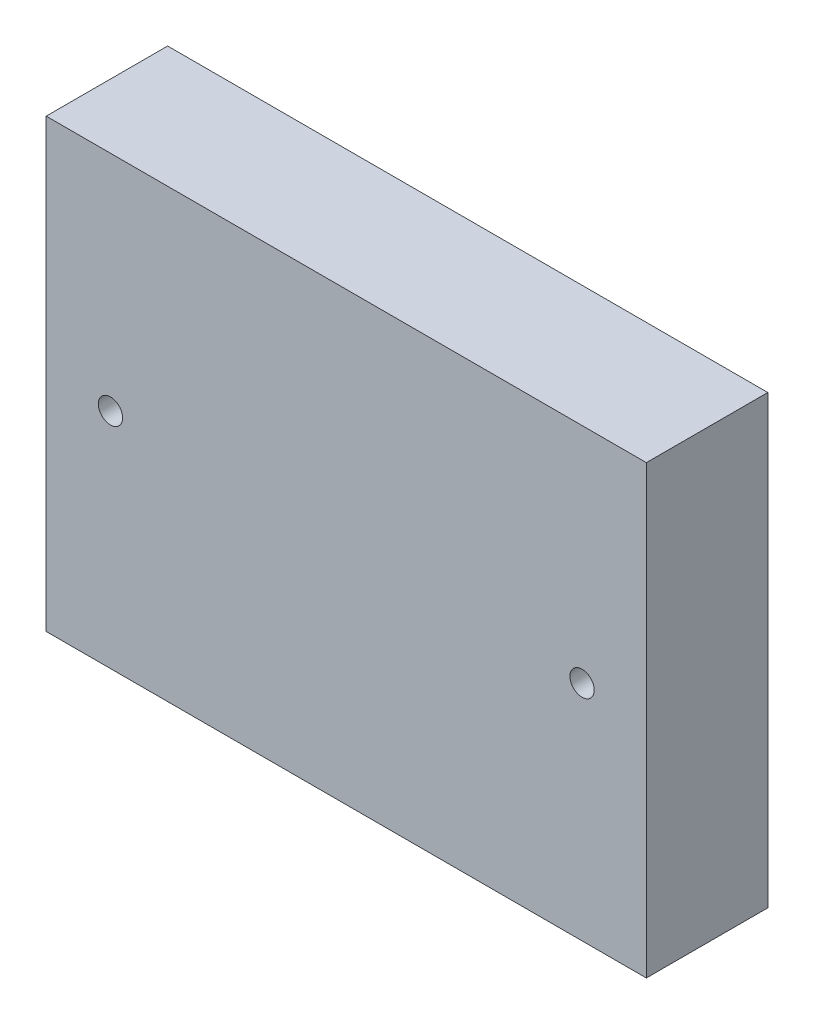
ISO-10303-21;
HEADER;
FILE_DESCRIPTION(('STEP AP214'),'2;1');
FILE_NAME('part.step','',(''),(''),'','','');
FILE_SCHEMA(('AUTOMOTIVE_DESIGN { 1 0 10303 214 1 1 1 1 }'));
ENDSEC;
DATA;
#1=APPLICATION_CONTEXT('core data for automotive mechanical design processes');
#2=APPLICATION_PROTOCOL_DEFINITION('international standard','automotive_design',2000,#1);
#3=PRODUCT_CONTEXT('',#1,'mechanical');
#4=PRODUCT('Part','Part','',(#3));
#5=PRODUCT_RELATED_PRODUCT_CATEGORY('part','',(#4));
#6=PRODUCT_DEFINITION_FORMATION('','',#4);
#7=PRODUCT_DEFINITION_CONTEXT('part definition',#1,'design');
#8=PRODUCT_DEFINITION('design','',#6,#7);
#9=PRODUCT_DEFINITION_SHAPE('','',#8);
#10=(LENGTH_UNIT() NAMED_UNIT(*) SI_UNIT(.MILLI.,.METRE.));
#11=(NAMED_UNIT(*) PLANE_ANGLE_UNIT() SI_UNIT($,.RADIAN.));
#12=(NAMED_UNIT(*) SI_UNIT($,.STERADIAN.) SOLID_ANGLE_UNIT());
#13=UNCERTAINTY_MEASURE_WITH_UNIT(LENGTH_MEASURE(1.E-05),#10,'distance_accuracy_value','');
#14=(GEOMETRIC_REPRESENTATION_CONTEXT(3) GLOBAL_UNCERTAINTY_ASSIGNED_CONTEXT((#13)) GLOBAL_UNIT_ASSIGNED_CONTEXT((#10,
#11,#12)) REPRESENTATION_CONTEXT('',''));
#15=CARTESIAN_POINT('',(0.,0.,0.));
#16=DIRECTION('',(0.,0.,1.));
#17=DIRECTION('',(1.,0.,0.));
#18=AXIS2_PLACEMENT_3D('',#15,#16,#17);
#19=CARTESIAN_POINT('',(0.,0.,9.525));
#20=DIRECTION('',(1.,0.,0.));
#21=DIRECTION('',(0.,0.,-1.));
#22=AXIS2_PLACEMENT_3D('',#19,#20,#21);
#23=PLANE('',#22);
#24=DIRECTION('',(0.,-1.,0.));
#25=VECTOR('',#24,1.);
#26=CARTESIAN_POINT('',(0.,0.,0.));
#27=LINE('',#26,#25);
#28=CARTESIAN_POINT('',(0.,35.0012,0.));
#29=VERTEX_POINT('',#28);
#30=CARTESIAN_POINT('',(0.,0.,0.));
#31=VERTEX_POINT('',#30);
#32=EDGE_CURVE('E98',#29,#31,#27,.T.);
#33=ORIENTED_EDGE('',*,*,#32,.T.);
#34=DIRECTION('',(0.,0.,-1.));
#35=VECTOR('',#34,1.);
#36=CARTESIAN_POINT('',(0.,0.,9.525));
#37=LINE('',#36,#35);
#38=CARTESIAN_POINT('',(0.,0.,9.525));
#39=VERTEX_POINT('',#38);
#40=EDGE_CURVE('E11',#39,#31,#37,.T.);
#41=ORIENTED_EDGE('',*,*,#40,.F.);
#42=DIRECTION('',(0.,-1.,0.));
#43=VECTOR('',#42,1.);
#44=CARTESIAN_POINT('',(0.,0.,9.525));
#45=LINE('',#44,#43);
#46=CARTESIAN_POINT('',(0.,35.0012,9.525));
#47=VERTEX_POINT('',#46);
#48=EDGE_CURVE('E86',#47,#39,#45,.T.);
#49=ORIENTED_EDGE('',*,*,#48,.F.);
#50=DIRECTION('',(0.,0.,-1.));
#51=VECTOR('',#50,1.);
#52=CARTESIAN_POINT('',(0.,35.0012,9.525));
#53=LINE('',#52,#51);
#54=EDGE_CURVE('E94',#47,#29,#53,.T.);
#55=ORIENTED_EDGE('',*,*,#54,.T.);
#56=EDGE_LOOP('',(#33,#41,#49,#55));
#57=FACE_BOUND('',#56,.T.);
#58=ADVANCED_FACE('F35',(#57),#23,.F.);
#59=CARTESIAN_POINT('',(0.,0.,9.525));
#60=DIRECTION('',(0.,1.,0.));
#61=DIRECTION('',(0.,0.,1.));
#62=AXIS2_PLACEMENT_3D('',#59,#60,#61);
#63=PLANE('',#62);
#64=DIRECTION('',(1.,0.,0.));
#65=VECTOR('',#64,1.);
#66=CARTESIAN_POINT('',(0.,0.,0.));
#67=LINE('',#66,#65);
#68=CARTESIAN_POINT('',(47.0662,0.,0.));
#69=VERTEX_POINT('',#68);
#70=EDGE_CURVE('E90',#31,#69,#67,.T.);
#71=ORIENTED_EDGE('',*,*,#70,.T.);
#72=DIRECTION('',(0.,0.,-1.));
#73=VECTOR('',#72,1.);
#74=CARTESIAN_POINT('',(47.0662,0.,9.525));
#75=LINE('',#74,#73);
#76=CARTESIAN_POINT('',(47.0662,0.,9.525));
#77=VERTEX_POINT('',#76);
#78=EDGE_CURVE('E43',#77,#69,#75,.T.);
#79=ORIENTED_EDGE('',*,*,#78,.F.);
#80=DIRECTION('',(1.,0.,0.));
#81=VECTOR('',#80,1.);
#82=CARTESIAN_POINT('',(0.,0.,9.525));
#83=LINE('',#82,#81);
#84=EDGE_CURVE('E81',#39,#77,#83,.T.);
#85=ORIENTED_EDGE('',*,*,#84,.F.);
#86=ORIENTED_EDGE('',*,*,#40,.T.);
#87=EDGE_LOOP('',(#71,#79,#85,#86));
#88=FACE_BOUND('',#87,.T.);
#89=ADVANCED_FACE('F89',(#88),#63,.F.);
#90=CARTESIAN_POINT('',(47.0662,0.,9.525));
#91=DIRECTION('',(-1.,0.,0.));
#92=DIRECTION('',(0.,0.,1.));
#93=AXIS2_PLACEMENT_3D('',#90,#91,#92);
#94=PLANE('',#93);
#95=DIRECTION('',(0.,1.,0.));
#96=VECTOR('',#95,1.);
#97=CARTESIAN_POINT('',(47.0662,0.,0.));
#98=LINE('',#97,#96);
#99=CARTESIAN_POINT('',(47.0662,35.0012,0.));
#100=VERTEX_POINT('',#99);
#101=EDGE_CURVE('E68',#69,#100,#98,.T.);
#102=ORIENTED_EDGE('',*,*,#101,.T.);
#103=DIRECTION('',(0.,0.,-1.));
#104=VECTOR('',#103,1.);
#105=CARTESIAN_POINT('',(47.0662,35.0012,9.525));
#106=LINE('',#105,#104);
#107=CARTESIAN_POINT('',(47.0662,35.0012,9.525));
#108=VERTEX_POINT('',#107);
#109=EDGE_CURVE('E91',#108,#100,#106,.T.);
#110=ORIENTED_EDGE('',*,*,#109,.F.);
#111=DIRECTION('',(0.,1.,0.));
#112=VECTOR('',#111,1.);
#113=CARTESIAN_POINT('',(47.0662,0.,9.525));
#114=LINE('',#113,#112);
#115=EDGE_CURVE('E84',#77,#108,#114,.T.);
#116=ORIENTED_EDGE('',*,*,#115,.F.);
#117=ORIENTED_EDGE('',*,*,#78,.T.);
#118=EDGE_LOOP('',(#102,#110,#116,#117));
#119=FACE_BOUND('',#118,.T.);
#120=ADVANCED_FACE('F92',(#119),#94,.F.);
#121=CARTESIAN_POINT('',(0.,35.0012,9.525));
#122=DIRECTION('',(0.,-1.,0.));
#123=DIRECTION('',(0.,0.,-1.));
#124=AXIS2_PLACEMENT_3D('',#121,#122,#123);
#125=PLANE('',#124);
#126=DIRECTION('',(-1.,0.,0.));
#127=VECTOR('',#126,1.);
#128=CARTESIAN_POINT('',(0.,35.0012,0.));
#129=LINE('',#128,#127);
#130=EDGE_CURVE('E74',#100,#29,#129,.T.);
#131=ORIENTED_EDGE('',*,*,#130,.T.);
#132=ORIENTED_EDGE('',*,*,#54,.F.);
#133=DIRECTION('',(-1.,0.,0.));
#134=VECTOR('',#133,1.);
#135=CARTESIAN_POINT('',(0.,35.0012,9.525));
#136=LINE('',#135,#134);
#137=EDGE_CURVE('E51',#108,#47,#136,.T.);
#138=ORIENTED_EDGE('',*,*,#137,.F.);
#139=ORIENTED_EDGE('',*,*,#109,.T.);
#140=EDGE_LOOP('',(#131,#132,#138,#139));
#141=FACE_BOUND('',#140,.T.);
#142=ADVANCED_FACE('F106',(#141),#125,.F.);
#143=CARTESIAN_POINT('',(0.,0.,9.525));
#144=DIRECTION('',(0.,0.,-1.));
#145=DIRECTION('',(-1.,0.,0.));
#146=AXIS2_PLACEMENT_3D('',#143,#144,#145);
#147=PLANE('',#146);
#148=CARTESIAN_POINT('',(42.0243,17.5006,9.525));
#149=DIRECTION('',(0.,0.,-1.));
#150=DIRECTION('',(1.,0.,0.));
#151=AXIS2_PLACEMENT_3D('',#148,#149,#150);
#152=CIRCLE('',#151,0.952499999999997);
#153=CARTESIAN_POINT('',(42.9768,17.5006,9.525));
#154=VERTEX_POINT('',#153);
#155=EDGE_CURVE('E115',#154,#154,#152,.T.);
#156=ORIENTED_EDGE('',*,*,#155,.T.);
#157=EDGE_LOOP('',(#156));
#158=FACE_BOUND('',#157,.T.);
#159=CARTESIAN_POINT('',(5.04189999999999,17.5006,9.525));
#160=DIRECTION('',(0.,0.,-1.));
#161=DIRECTION('',(-1.,0.,0.));
#162=AXIS2_PLACEMENT_3D('',#159,#160,#161);
#163=CIRCLE('',#162,0.9525);
#164=CARTESIAN_POINT('',(4.0894,17.5006,9.525));
#165=VERTEX_POINT('',#164);
#166=EDGE_CURVE('E101',#165,#165,#163,.T.);
#167=ORIENTED_EDGE('',*,*,#166,.T.);
#168=EDGE_LOOP('',(#167));
#169=FACE_BOUND('',#168,.T.);
#170=ORIENTED_EDGE('',*,*,#48,.T.);
#171=ORIENTED_EDGE('',*,*,#84,.T.);
#172=ORIENTED_EDGE('',*,*,#115,.T.);
#173=ORIENTED_EDGE('',*,*,#137,.T.);
#174=EDGE_LOOP('',(#170,#171,#172,#173));
#175=FACE_BOUND('',#174,.T.);
#176=ADVANCED_FACE('F82',(#158,#169,#175),#147,.F.);
#177=CARTESIAN_POINT('',(0.,0.,0.));
#178=DIRECTION('',(0.,0.,-1.));
#179=DIRECTION('',(-1.,0.,0.));
#180=AXIS2_PLACEMENT_3D('',#177,#178,#179);
#181=PLANE('',#180);
#182=CARTESIAN_POINT('',(42.0243,17.5006,0.));
#183=DIRECTION('',(0.,0.,-1.));
#184=DIRECTION('',(1.,0.,0.));
#185=AXIS2_PLACEMENT_3D('',#182,#183,#184);
#186=CIRCLE('',#185,0.952499999999997);
#187=CARTESIAN_POINT('',(42.9768,17.5006,0.));
#188=VERTEX_POINT('',#187);
#189=EDGE_CURVE('E118',#188,#188,#186,.T.);
#190=ORIENTED_EDGE('',*,*,#189,.F.);
#191=EDGE_LOOP('',(#190));
#192=FACE_BOUND('',#191,.T.);
#193=CARTESIAN_POINT('',(5.04189999999999,17.5006,0.));
#194=DIRECTION('',(0.,0.,-1.));
#195=DIRECTION('',(-1.,0.,0.));
#196=AXIS2_PLACEMENT_3D('',#193,#194,#195);
#197=CIRCLE('',#196,0.9525);
#198=CARTESIAN_POINT('',(4.0894,17.5006,0.));
#199=VERTEX_POINT('',#198);
#200=EDGE_CURVE('E112',#199,#199,#197,.T.);
#201=ORIENTED_EDGE('',*,*,#200,.F.);
#202=EDGE_LOOP('',(#201));
#203=FACE_BOUND('',#202,.T.);
#204=ORIENTED_EDGE('',*,*,#32,.F.);
#205=ORIENTED_EDGE('',*,*,#130,.F.);
#206=ORIENTED_EDGE('',*,*,#101,.F.);
#207=ORIENTED_EDGE('',*,*,#70,.F.);
#208=EDGE_LOOP('',(#204,#205,#206,#207));
#209=FACE_BOUND('',#208,.T.);
#210=ADVANCED_FACE('F109',(#192,#203,#209),#181,.T.);
#211=CARTESIAN_POINT('',(5.04189999999999,17.5006,9.525));
#212=DIRECTION('',(0.,0.,-1.));
#213=DIRECTION('',(-1.,0.,0.));
#214=AXIS2_PLACEMENT_3D('',#211,#212,#213);
#215=CYLINDRICAL_SURFACE('',#214,0.9525);
#216=ORIENTED_EDGE('',*,*,#166,.F.);
#217=EDGE_LOOP('',(#216));
#218=FACE_BOUND('',#217,.T.);
#219=ORIENTED_EDGE('',*,*,#200,.T.);
#220=EDGE_LOOP('',(#219));
#221=FACE_BOUND('',#220,.T.);
#222=ADVANCED_FACE('F129',(#218,#221),#215,.F.);
#223=CARTESIAN_POINT('',(42.0243,17.5006,9.525));
#224=DIRECTION('',(0.,0.,-1.));
#225=DIRECTION('',(-1.,0.,0.));
#226=AXIS2_PLACEMENT_3D('',#223,#224,#225);
#227=CYLINDRICAL_SURFACE('',#226,0.952499999999997);
#228=ORIENTED_EDGE('',*,*,#155,.F.);
#229=EDGE_LOOP('',(#228));
#230=FACE_BOUND('',#229,.T.);
#231=ORIENTED_EDGE('',*,*,#189,.T.);
#232=EDGE_LOOP('',(#231));
#233=FACE_BOUND('',#232,.T.);
#234=ADVANCED_FACE('F126',(#230,#233),#227,.F.);
#235=CLOSED_SHELL('',(#58,#89,#120,#142,#176,#210,#222,#234));
#236=MANIFOLD_SOLID_BREP('B2',#235);
#237=ADVANCED_BREP_SHAPE_REPRESENTATION('',(#18,#236),#14);
#238=SHAPE_DEFINITION_REPRESENTATION(#9,#237);
ENDSEC;
END-ISO-10303-21;
